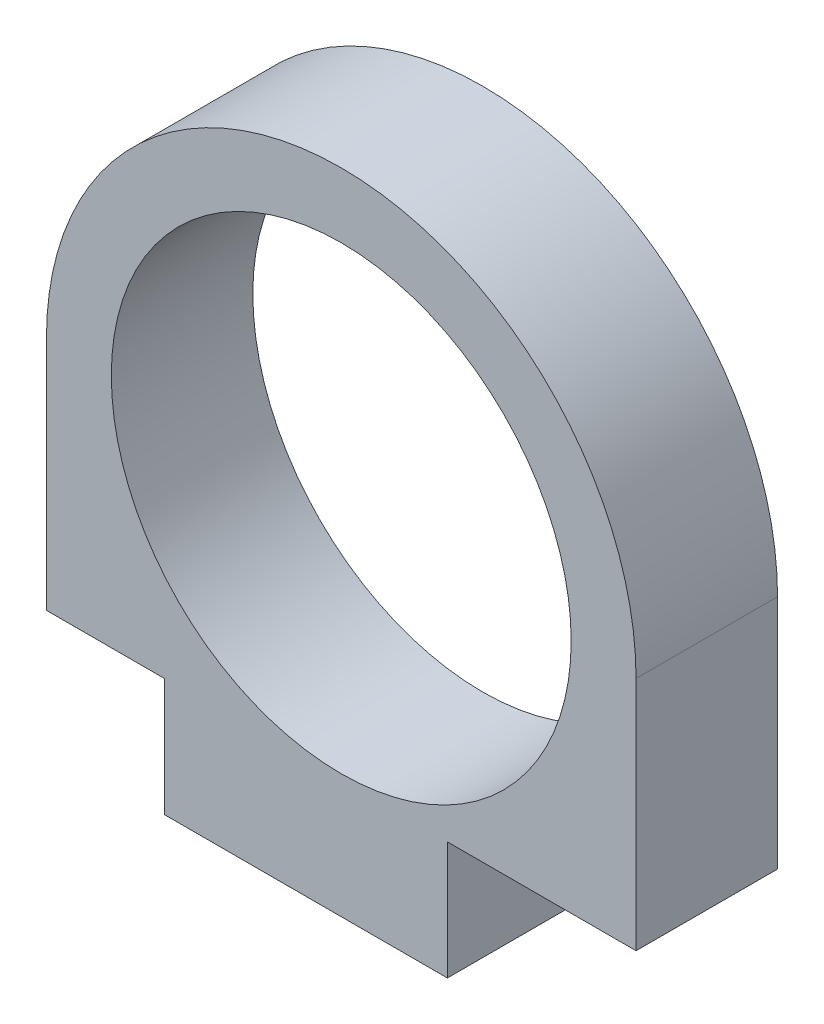
ISO-10303-21;
HEADER;
FILE_DESCRIPTION(('STEP AP214'),'2;1');
FILE_NAME('part.step','',(''),(''),'','','');
FILE_SCHEMA(('AUTOMOTIVE_DESIGN { 1 0 10303 214 1 1 1 1 }'));
ENDSEC;
DATA;
#1=APPLICATION_CONTEXT('core data for automotive mechanical design processes');
#2=APPLICATION_PROTOCOL_DEFINITION('international standard','automotive_design',2000,#1);
#3=PRODUCT_CONTEXT('',#1,'mechanical');
#4=PRODUCT('Part','Part','',(#3));
#5=PRODUCT_RELATED_PRODUCT_CATEGORY('part','',(#4));
#6=PRODUCT_DEFINITION_FORMATION('','',#4);
#7=PRODUCT_DEFINITION_CONTEXT('part definition',#1,'design');
#8=PRODUCT_DEFINITION('design','',#6,#7);
#9=PRODUCT_DEFINITION_SHAPE('','',#8);
#10=(LENGTH_UNIT() NAMED_UNIT(*) SI_UNIT(.MILLI.,.METRE.));
#11=(NAMED_UNIT(*) PLANE_ANGLE_UNIT() SI_UNIT($,.RADIAN.));
#12=(NAMED_UNIT(*) SI_UNIT($,.STERADIAN.) SOLID_ANGLE_UNIT());
#13=UNCERTAINTY_MEASURE_WITH_UNIT(LENGTH_MEASURE(1.E-05),#10,'distance_accuracy_value','');
#14=(GEOMETRIC_REPRESENTATION_CONTEXT(3) GLOBAL_UNCERTAINTY_ASSIGNED_CONTEXT((#13)) GLOBAL_UNIT_ASSIGNED_CONTEXT((#10,
#11,#12)) REPRESENTATION_CONTEXT('',''));
#15=CARTESIAN_POINT('',(0.,0.,0.));
#16=DIRECTION('',(0.,0.,1.));
#17=DIRECTION('',(1.,0.,0.));
#18=AXIS2_PLACEMENT_3D('',#15,#16,#17);
#19=CARTESIAN_POINT('',(0.,-10.,6.));
#20=DIRECTION('',(0.,1.,0.));
#21=DIRECTION('',(0.,0.,1.));
#22=AXIS2_PLACEMENT_3D('',#19,#20,#21);
#23=PLANE('',#22);
#24=DIRECTION('',(1.,0.,0.));
#25=VECTOR('',#24,1.);
#26=CARTESIAN_POINT('',(0.,-10.,0.));
#27=LINE('',#26,#25);
#28=CARTESIAN_POINT('',(-12.5,-10.,0.));
#29=VERTEX_POINT('',#28);
#30=CARTESIAN_POINT('',(-7.5,-10.,0.));
#31=VERTEX_POINT('',#30);
#32=EDGE_CURVE('E139',#29,#31,#27,.T.);
#33=ORIENTED_EDGE('',*,*,#32,.T.);
#34=DIRECTION('',(0.,0.,-1.));
#35=VECTOR('',#34,1.);
#36=CARTESIAN_POINT('',(-7.5,-10.,6.));
#37=LINE('',#36,#35);
#38=CARTESIAN_POINT('',(-7.5,-10.,6.));
#39=VERTEX_POINT('',#38);
#40=EDGE_CURVE('E11',#39,#31,#37,.T.);
#41=ORIENTED_EDGE('',*,*,#40,.F.);
#42=DIRECTION('',(1.,0.,0.));
#43=VECTOR('',#42,1.);
#44=CARTESIAN_POINT('',(0.,-10.,6.));
#45=LINE('',#44,#43);
#46=CARTESIAN_POINT('',(-12.5,-10.,6.));
#47=VERTEX_POINT('',#46);
#48=EDGE_CURVE('E130',#47,#39,#45,.T.);
#49=ORIENTED_EDGE('',*,*,#48,.F.);
#50=DIRECTION('',(0.,0.,-1.));
#51=VECTOR('',#50,1.);
#52=CARTESIAN_POINT('',(-12.5,-10.,6.));
#53=LINE('',#52,#51);
#54=EDGE_CURVE('E135',#47,#29,#53,.T.);
#55=ORIENTED_EDGE('',*,*,#54,.T.);
#56=EDGE_LOOP('',(#33,#41,#49,#55));
#57=FACE_BOUND('',#56,.T.);
#58=ADVANCED_FACE('F35',(#57),#23,.F.);
#59=CARTESIAN_POINT('',(-7.5,0.,6.));
#60=DIRECTION('',(1.,0.,0.));
#61=DIRECTION('',(0.,1.,0.));
#62=AXIS2_PLACEMENT_3D('',#59,#60,#61);
#63=PLANE('',#62);
#64=DIRECTION('',(0.,-1.,0.));
#65=VECTOR('',#64,1.);
#66=CARTESIAN_POINT('',(-7.5,0.,0.));
#67=LINE('',#66,#65);
#68=CARTESIAN_POINT('',(-7.5,-15.,0.));
#69=VERTEX_POINT('',#68);
#70=EDGE_CURVE('E142',#31,#69,#67,.T.);
#71=ORIENTED_EDGE('',*,*,#70,.T.);
#72=DIRECTION('',(0.,0.,-1.));
#73=VECTOR('',#72,1.);
#74=CARTESIAN_POINT('',(-7.5,-15.,6.));
#75=LINE('',#74,#73);
#76=CARTESIAN_POINT('',(-7.5,-15.,6.));
#77=VERTEX_POINT('',#76);
#78=EDGE_CURVE('E44',#77,#69,#75,.T.);
#79=ORIENTED_EDGE('',*,*,#78,.F.);
#80=DIRECTION('',(0.,-1.,0.));
#81=VECTOR('',#80,1.);
#82=CARTESIAN_POINT('',(-7.5,0.,6.));
#83=LINE('',#82,#81);
#84=EDGE_CURVE('E94',#39,#77,#83,.T.);
#85=ORIENTED_EDGE('',*,*,#84,.F.);
#86=ORIENTED_EDGE('',*,*,#40,.T.);
#87=EDGE_LOOP('',(#71,#79,#85,#86));
#88=FACE_BOUND('',#87,.T.);
#89=ADVANCED_FACE('F195',(#88),#63,.F.);
#90=CARTESIAN_POINT('',(0.,-15.,6.));
#91=DIRECTION('',(0.,1.,0.));
#92=DIRECTION('',(0.,0.,1.));
#93=AXIS2_PLACEMENT_3D('',#90,#91,#92);
#94=PLANE('',#93);
#95=DIRECTION('',(1.,0.,0.));
#96=VECTOR('',#95,1.);
#97=CARTESIAN_POINT('',(0.,-15.,0.));
#98=LINE('',#97,#96);
#99=CARTESIAN_POINT('',(4.5,-15.,0.));
#100=VERTEX_POINT('',#99);
#101=EDGE_CURVE('E145',#69,#100,#98,.T.);
#102=ORIENTED_EDGE('',*,*,#101,.T.);
#103=DIRECTION('',(0.,0.,-1.));
#104=VECTOR('',#103,1.);
#105=CARTESIAN_POINT('',(4.5,-15.,6.));
#106=LINE('',#105,#104);
#107=CARTESIAN_POINT('',(4.5,-15.,6.));
#108=VERTEX_POINT('',#107);
#109=EDGE_CURVE('E160',#108,#100,#106,.T.);
#110=ORIENTED_EDGE('',*,*,#109,.F.);
#111=DIRECTION('',(1.,0.,0.));
#112=VECTOR('',#111,1.);
#113=CARTESIAN_POINT('',(0.,-15.,6.));
#114=LINE('',#113,#112);
#115=EDGE_CURVE('E167',#77,#108,#114,.T.);
#116=ORIENTED_EDGE('',*,*,#115,.F.);
#117=ORIENTED_EDGE('',*,*,#78,.T.);
#118=EDGE_LOOP('',(#102,#110,#116,#117));
#119=FACE_BOUND('',#118,.T.);
#120=ADVANCED_FACE('F165',(#119),#94,.F.);
#121=CARTESIAN_POINT('',(4.5,0.,6.));
#122=DIRECTION('',(1.,0.,0.));
#123=DIRECTION('',(0.,0.,-1.));
#124=AXIS2_PLACEMENT_3D('',#121,#122,#123);
#125=PLANE('',#124);
#126=DIRECTION('',(0.,-1.,0.));
#127=VECTOR('',#126,1.);
#128=CARTESIAN_POINT('',(4.5,0.,0.));
#129=LINE('',#128,#127);
#130=CARTESIAN_POINT('',(4.5,-10.,0.));
#131=VERTEX_POINT('',#130);
#132=EDGE_CURVE('E148',#131,#100,#129,.T.);
#133=ORIENTED_EDGE('',*,*,#132,.F.);
#134=DIRECTION('',(0.,0.,-1.));
#135=VECTOR('',#134,1.);
#136=CARTESIAN_POINT('',(4.5,-10.,6.));
#137=LINE('',#136,#135);
#138=CARTESIAN_POINT('',(4.5,-10.,6.));
#139=VERTEX_POINT('',#138);
#140=EDGE_CURVE('E158',#139,#131,#137,.T.);
#141=ORIENTED_EDGE('',*,*,#140,.F.);
#142=DIRECTION('',(0.,-1.,0.));
#143=VECTOR('',#142,1.);
#144=CARTESIAN_POINT('',(4.5,0.,6.));
#145=LINE('',#144,#143);
#146=EDGE_CURVE('E128',#139,#108,#145,.T.);
#147=ORIENTED_EDGE('',*,*,#146,.T.);
#148=ORIENTED_EDGE('',*,*,#109,.T.);
#149=EDGE_LOOP('',(#133,#141,#147,#148));
#150=FACE_BOUND('',#149,.T.);
#151=ADVANCED_FACE('F175',(#150),#125,.T.);
#152=CARTESIAN_POINT('',(12.5,-10.,0.));
#153=VERTEX_POINT('',#152);
#154=EDGE_CURVE('E143',#131,#153,#27,.T.);
#155=ORIENTED_EDGE('',*,*,#154,.T.);
#156=DIRECTION('',(0.,0.,-1.));
#157=VECTOR('',#156,1.);
#158=CARTESIAN_POINT('',(12.5,-10.,6.));
#159=LINE('',#158,#157);
#160=CARTESIAN_POINT('',(12.5,-10.,6.));
#161=VERTEX_POINT('',#160);
#162=EDGE_CURVE('E116',#161,#153,#159,.T.);
#163=ORIENTED_EDGE('',*,*,#162,.F.);
#164=EDGE_CURVE('E125',#139,#161,#45,.T.);
#165=ORIENTED_EDGE('',*,*,#164,.F.);
#166=ORIENTED_EDGE('',*,*,#140,.T.);
#167=EDGE_LOOP('',(#155,#163,#165,#166));
#168=FACE_BOUND('',#167,.T.);
#169=ADVANCED_FACE('F198',(#168),#23,.F.);
#170=CARTESIAN_POINT('',(12.5,0.,6.));
#171=DIRECTION('',(1.,0.,0.));
#172=DIRECTION('',(0.,1.,0.));
#173=AXIS2_PLACEMENT_3D('',#170,#171,#172);
#174=PLANE('',#173);
#175=DIRECTION('',(0.,-1.,0.));
#176=VECTOR('',#175,1.);
#177=CARTESIAN_POINT('',(12.5,0.,0.));
#178=LINE('',#177,#176);
#179=CARTESIAN_POINT('',(12.5,0.,0.));
#180=VERTEX_POINT('',#179);
#181=EDGE_CURVE('E115',#180,#153,#178,.T.);
#182=ORIENTED_EDGE('',*,*,#181,.F.);
#183=DIRECTION('',(0.,0.,-1.));
#184=VECTOR('',#183,1.);
#185=CARTESIAN_POINT('',(12.5,0.,6.));
#186=LINE('',#185,#184);
#187=CARTESIAN_POINT('',(12.5,0.,6.));
#188=VERTEX_POINT('',#187);
#189=EDGE_CURVE('E109',#188,#180,#186,.T.);
#190=ORIENTED_EDGE('',*,*,#189,.F.);
#191=DIRECTION('',(0.,-1.,0.));
#192=VECTOR('',#191,1.);
#193=CARTESIAN_POINT('',(12.5,0.,6.));
#194=LINE('',#193,#192);
#195=EDGE_CURVE('E113',#188,#161,#194,.T.);
#196=ORIENTED_EDGE('',*,*,#195,.T.);
#197=ORIENTED_EDGE('',*,*,#162,.T.);
#198=EDGE_LOOP('',(#182,#190,#196,#197));
#199=FACE_BOUND('',#198,.T.);
#200=ADVANCED_FACE('F111',(#199),#174,.T.);
#201=CARTESIAN_POINT('',(0.,0.,6.));
#202=DIRECTION('',(0.,0.,-1.));
#203=DIRECTION('',(-1.,0.,0.));
#204=AXIS2_PLACEMENT_3D('',#201,#202,#203);
#205=CYLINDRICAL_SURFACE('',#204,12.5);
#206=CARTESIAN_POINT('',(0.,0.,0.));
#207=DIRECTION('',(0.,0.,1.));
#208=DIRECTION('',(1.,0.,0.));
#209=AXIS2_PLACEMENT_3D('',#206,#207,#208);
#210=CIRCLE('',#209,12.5);
#211=CARTESIAN_POINT('',(-12.5,0.,0.));
#212=VERTEX_POINT('',#211);
#213=EDGE_CURVE('E80',#180,#212,#210,.T.);
#214=ORIENTED_EDGE('',*,*,#213,.T.);
#215=DIRECTION('',(0.,0.,-1.));
#216=VECTOR('',#215,1.);
#217=CARTESIAN_POINT('',(-12.5,0.,6.));
#218=LINE('',#217,#216);
#219=CARTESIAN_POINT('',(-12.5,0.,6.));
#220=VERTEX_POINT('',#219);
#221=EDGE_CURVE('E117',#220,#212,#218,.T.);
#222=ORIENTED_EDGE('',*,*,#221,.F.);
#223=CARTESIAN_POINT('',(0.,0.,6.));
#224=DIRECTION('',(0.,0.,1.));
#225=DIRECTION('',(1.,0.,0.));
#226=AXIS2_PLACEMENT_3D('',#223,#224,#225);
#227=CIRCLE('',#226,12.5);
#228=EDGE_CURVE('E119',#188,#220,#227,.T.);
#229=ORIENTED_EDGE('',*,*,#228,.F.);
#230=ORIENTED_EDGE('',*,*,#189,.T.);
#231=EDGE_LOOP('',(#214,#222,#229,#230));
#232=FACE_BOUND('',#231,.T.);
#233=ADVANCED_FACE('F120',(#232),#205,.T.);
#234=CARTESIAN_POINT('',(0.,0.,6.));
#235=DIRECTION('',(0.,0.,-1.));
#236=DIRECTION('',(-1.,0.,0.));
#237=AXIS2_PLACEMENT_3D('',#234,#235,#236);
#238=CYLINDRICAL_SURFACE('',#237,9.75);
#239=CARTESIAN_POINT('',(0.,0.,6.));
#240=DIRECTION('',(0.,0.,1.));
#241=DIRECTION('',(1.,0.,0.));
#242=AXIS2_PLACEMENT_3D('',#239,#240,#241);
#243=CIRCLE('',#242,9.75);
#244=CARTESIAN_POINT('',(9.75,0.,6.));
#245=VERTEX_POINT('',#244);
#246=EDGE_CURVE('E154',#245,#245,#243,.T.);
#247=ORIENTED_EDGE('',*,*,#246,.T.);
#248=EDGE_LOOP('',(#247));
#249=FACE_BOUND('',#248,.T.);
#250=CARTESIAN_POINT('',(0.,0.,0.));
#251=DIRECTION('',(0.,0.,1.));
#252=DIRECTION('',(1.,0.,0.));
#253=AXIS2_PLACEMENT_3D('',#250,#251,#252);
#254=CIRCLE('',#253,9.75);
#255=CARTESIAN_POINT('',(9.75,0.,0.));
#256=VERTEX_POINT('',#255);
#257=EDGE_CURVE('E136',#256,#256,#254,.T.);
#258=ORIENTED_EDGE('',*,*,#257,.F.);
#259=EDGE_LOOP('',(#258));
#260=FACE_BOUND('',#259,.T.);
#261=ADVANCED_FACE('F37',(#249,#260),#238,.F.);
#262=CARTESIAN_POINT('',(-12.5,0.,6.));
#263=DIRECTION('',(1.,0.,0.));
#264=DIRECTION('',(0.,1.,0.));
#265=AXIS2_PLACEMENT_3D('',#262,#263,#264);
#266=PLANE('',#265);
#267=DIRECTION('',(0.,-1.,0.));
#268=VECTOR('',#267,1.);
#269=CARTESIAN_POINT('',(-12.5,0.,0.));
#270=LINE('',#269,#268);
#271=EDGE_CURVE('E86',#212,#29,#270,.T.);
#272=ORIENTED_EDGE('',*,*,#271,.T.);
#273=ORIENTED_EDGE('',*,*,#54,.F.);
#274=DIRECTION('',(0.,-1.,0.));
#275=VECTOR('',#274,1.);
#276=CARTESIAN_POINT('',(-12.5,0.,6.));
#277=LINE('',#276,#275);
#278=EDGE_CURVE('E52',#220,#47,#277,.T.);
#279=ORIENTED_EDGE('',*,*,#278,.F.);
#280=ORIENTED_EDGE('',*,*,#221,.T.);
#281=EDGE_LOOP('',(#272,#273,#279,#280));
#282=FACE_BOUND('',#281,.T.);
#283=ADVANCED_FACE('F185',(#282),#266,.F.);
#284=CARTESIAN_POINT('',(0.,0.,6.));
#285=DIRECTION('',(0.,0.,1.));
#286=DIRECTION('',(1.,0.,0.));
#287=AXIS2_PLACEMENT_3D('',#284,#285,#286);
#288=PLANE('',#287);
#289=ORIENTED_EDGE('',*,*,#246,.F.);
#290=EDGE_LOOP('',(#289));
#291=FACE_BOUND('',#290,.T.);
#292=ORIENTED_EDGE('',*,*,#48,.T.);
#293=ORIENTED_EDGE('',*,*,#84,.T.);
#294=ORIENTED_EDGE('',*,*,#115,.T.);
#295=ORIENTED_EDGE('',*,*,#146,.F.);
#296=ORIENTED_EDGE('',*,*,#164,.T.);
#297=ORIENTED_EDGE('',*,*,#195,.F.);
#298=ORIENTED_EDGE('',*,*,#228,.T.);
#299=ORIENTED_EDGE('',*,*,#278,.T.);
#300=EDGE_LOOP('',(#292,#293,#294,#295,#296,#297,#298,#299));
#301=FACE_BOUND('',#300,.T.);
#302=ADVANCED_FACE('F122',(#291,#301),#288,.T.);
#303=CARTESIAN_POINT('',(0.,0.,0.));
#304=DIRECTION('',(0.,0.,1.));
#305=DIRECTION('',(1.,0.,0.));
#306=AXIS2_PLACEMENT_3D('',#303,#304,#305);
#307=PLANE('',#306);
#308=ORIENTED_EDGE('',*,*,#257,.T.);
#309=EDGE_LOOP('',(#308));
#310=FACE_BOUND('',#309,.T.);
#311=ORIENTED_EDGE('',*,*,#32,.F.);
#312=ORIENTED_EDGE('',*,*,#271,.F.);
#313=ORIENTED_EDGE('',*,*,#213,.F.);
#314=ORIENTED_EDGE('',*,*,#181,.T.);
#315=ORIENTED_EDGE('',*,*,#154,.F.);
#316=ORIENTED_EDGE('',*,*,#132,.T.);
#317=ORIENTED_EDGE('',*,*,#101,.F.);
#318=ORIENTED_EDGE('',*,*,#70,.F.);
#319=EDGE_LOOP('',(#311,#312,#313,#314,#315,#316,#317,#318));
#320=FACE_BOUND('',#319,.T.);
#321=ADVANCED_FACE('F170',(#310,#320),#307,.F.);
#322=CLOSED_SHELL('',(#58,#89,#120,#151,#169,#200,#233,#261,#283,#302,#321));
#323=MANIFOLD_SOLID_BREP('B2',#322);
#324=ADVANCED_BREP_SHAPE_REPRESENTATION('',(#18,#323),#14);
#325=SHAPE_DEFINITION_REPRESENTATION(#9,#324);
ENDSEC;
END-ISO-10303-21;
